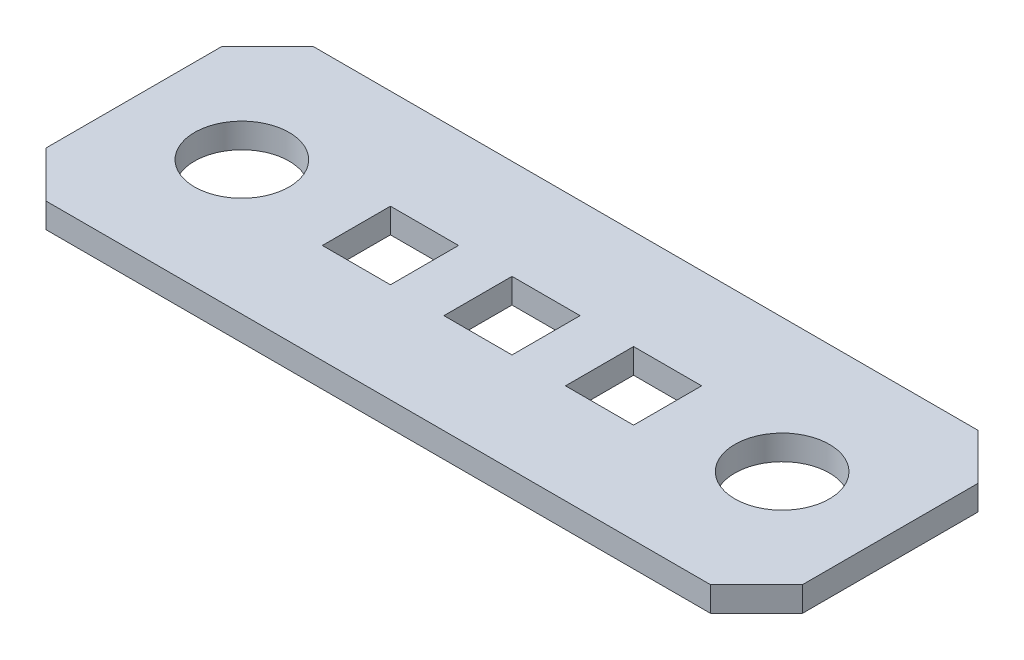
ISO-10303-21;
HEADER;
FILE_DESCRIPTION(('STEP AP214'),'2;1');
FILE_NAME('part.step','',(''),(''),'','','');
FILE_SCHEMA(('AUTOMOTIVE_DESIGN { 1 0 10303 214 1 1 1 1 }'));
ENDSEC;
DATA;
#1=APPLICATION_CONTEXT('core data for automotive mechanical design processes');
#2=APPLICATION_PROTOCOL_DEFINITION('international standard','automotive_design',2000,#1);
#3=PRODUCT_CONTEXT('',#1,'mechanical');
#4=PRODUCT('Part','Part','',(#3));
#5=PRODUCT_RELATED_PRODUCT_CATEGORY('part','',(#4));
#6=PRODUCT_DEFINITION_FORMATION('','',#4);
#7=PRODUCT_DEFINITION_CONTEXT('part definition',#1,'design');
#8=PRODUCT_DEFINITION('design','',#6,#7);
#9=PRODUCT_DEFINITION_SHAPE('','',#8);
#10=(LENGTH_UNIT() NAMED_UNIT(*) SI_UNIT(.MILLI.,.METRE.));
#11=(NAMED_UNIT(*) PLANE_ANGLE_UNIT() SI_UNIT($,.RADIAN.));
#12=(NAMED_UNIT(*) SI_UNIT($,.STERADIAN.) SOLID_ANGLE_UNIT());
#13=UNCERTAINTY_MEASURE_WITH_UNIT(LENGTH_MEASURE(1.E-05),#10,'distance_accuracy_value','');
#14=(GEOMETRIC_REPRESENTATION_CONTEXT(3) GLOBAL_UNCERTAINTY_ASSIGNED_CONTEXT((#13)) GLOBAL_UNIT_ASSIGNED_CONTEXT((#10,
#11,#12)) REPRESENTATION_CONTEXT('',''));
#15=CARTESIAN_POINT('',(0.,0.,0.));
#16=DIRECTION('',(0.,0.,1.));
#17=DIRECTION('',(1.,0.,0.));
#18=AXIS2_PLACEMENT_3D('',#15,#16,#17);
#19=CARTESIAN_POINT('',(0.,0.,0.));
#20=DIRECTION('',(0.,1.,0.));
#21=DIRECTION('',(0.,0.,1.));
#22=AXIS2_PLACEMENT_3D('',#19,#20,#21);
#23=PLANE('',#22);
#24=DIRECTION('',(1.,0.,0.));
#25=VECTOR('',#24,1.);
#26=CARTESIAN_POINT('',(21.8948,0.,-4.6863));
#27=LINE('',#26,#25);
#28=CARTESIAN_POINT('',(21.8948,0.,-4.6863));
#29=VERTEX_POINT('',#28);
#30=CARTESIAN_POINT('',(25.0952,0.,-4.6863));
#31=VERTEX_POINT('',#30);
#32=EDGE_CURVE('E457',#29,#31,#27,.T.);
#33=ORIENTED_EDGE('',*,*,#32,.T.);
#34=DIRECTION('',(0.,0.,-1.));
#35=VECTOR('',#34,1.);
#36=CARTESIAN_POINT('',(25.0952,0.,-7.8867));
#37=LINE('',#36,#35);
#38=CARTESIAN_POINT('',(25.0952,0.,-7.8867));
#39=VERTEX_POINT('',#38);
#40=EDGE_CURVE('E450',#31,#39,#37,.T.);
#41=ORIENTED_EDGE('',*,*,#40,.T.);
#42=DIRECTION('',(-1.,0.,0.));
#43=VECTOR('',#42,1.);
#44=CARTESIAN_POINT('',(21.8948,0.,-7.8867));
#45=LINE('',#44,#43);
#46=CARTESIAN_POINT('',(21.8948,0.,-7.8867));
#47=VERTEX_POINT('',#46);
#48=EDGE_CURVE('E446',#39,#47,#45,.T.);
#49=ORIENTED_EDGE('',*,*,#48,.T.);
#50=DIRECTION('',(0.,0.,1.));
#51=VECTOR('',#50,1.);
#52=CARTESIAN_POINT('',(21.8948,0.,-7.8867));
#53=LINE('',#52,#51);
#54=EDGE_CURVE('E444',#47,#29,#53,.T.);
#55=ORIENTED_EDGE('',*,*,#54,.T.);
#56=EDGE_LOOP('',(#33,#41,#49,#55));
#57=FACE_BOUND('',#56,.T.);
#58=DIRECTION('',(0.707106781186544,0.,0.707106781186551));
#59=VECTOR('',#58,1.);
#60=CARTESIAN_POINT('',(33.401,0.,-12.573));
#61=LINE('',#60,#59);
#62=CARTESIAN_POINT('',(33.401,0.,-12.573));
#63=VERTEX_POINT('',#62);
#64=CARTESIAN_POINT('',(35.56,0.,-10.414));
#65=VERTEX_POINT('',#64);
#66=EDGE_CURVE('E412',#63,#65,#61,.T.);
#67=ORIENTED_EDGE('',*,*,#66,.T.);
#68=DIRECTION('',(0.,0.,1.));
#69=VECTOR('',#68,1.);
#70=CARTESIAN_POINT('',(35.56,0.,-12.573));
#71=LINE('',#70,#69);
#72=CARTESIAN_POINT('',(35.56,0.,-2.15900000000001));
#73=VERTEX_POINT('',#72);
#74=EDGE_CURVE('E410',#65,#73,#71,.T.);
#75=ORIENTED_EDGE('',*,*,#74,.T.);
#76=DIRECTION('',(-0.707106781186548,0.,0.707106781186548));
#77=VECTOR('',#76,1.);
#78=CARTESIAN_POINT('',(35.56,0.,-2.15900000000001));
#79=LINE('',#78,#77);
#80=CARTESIAN_POINT('',(33.401,0.,0.));
#81=VERTEX_POINT('',#80);
#82=EDGE_CURVE('E440',#73,#81,#79,.T.);
#83=ORIENTED_EDGE('',*,*,#82,.T.);
#84=DIRECTION('',(-1.,0.,0.));
#85=VECTOR('',#84,1.);
#86=CARTESIAN_POINT('',(0.,0.,0.));
#87=LINE('',#86,#85);
#88=CARTESIAN_POINT('',(2.15900000000001,0.,0.));
#89=VERTEX_POINT('',#88);
#90=EDGE_CURVE('E434',#81,#89,#87,.T.);
#91=ORIENTED_EDGE('',*,*,#90,.T.);
#92=DIRECTION('',(-0.707106781186548,0.,-0.707106781186548));
#93=VECTOR('',#92,1.);
#94=CARTESIAN_POINT('',(2.15900000000001,0.,0.));
#95=LINE('',#94,#93);
#96=CARTESIAN_POINT('',(0.,0.,-2.15900000000002));
#97=VERTEX_POINT('',#96);
#98=EDGE_CURVE('E428',#89,#97,#95,.T.);
#99=ORIENTED_EDGE('',*,*,#98,.T.);
#100=DIRECTION('',(0.,0.,-1.));
#101=VECTOR('',#100,1.);
#102=CARTESIAN_POINT('',(0.,0.,-12.573));
#103=LINE('',#102,#101);
#104=CARTESIAN_POINT('',(0.,0.,-10.414));
#105=VERTEX_POINT('',#104);
#106=EDGE_CURVE('E424',#97,#105,#103,.T.);
#107=ORIENTED_EDGE('',*,*,#106,.T.);
#108=DIRECTION('',(0.707106781186549,0.,-0.707106781186546));
#109=VECTOR('',#108,1.);
#110=CARTESIAN_POINT('',(0.,0.,-10.414));
#111=LINE('',#110,#109);
#112=CARTESIAN_POINT('',(2.15899999999999,0.,-12.573));
#113=VERTEX_POINT('',#112);
#114=EDGE_CURVE('E420',#105,#113,#111,.T.);
#115=ORIENTED_EDGE('',*,*,#114,.T.);
#116=DIRECTION('',(1.,0.,0.));
#117=VECTOR('',#116,1.);
#118=CARTESIAN_POINT('',(0.,0.,-12.573));
#119=LINE('',#118,#117);
#120=EDGE_CURVE('E416',#113,#63,#119,.T.);
#121=ORIENTED_EDGE('',*,*,#120,.T.);
#122=EDGE_LOOP('',(#67,#75,#83,#91,#99,#107,#115,#121));
#123=FACE_BOUND('',#122,.T.);
#124=DIRECTION('',(0.,0.,1.));
#125=VECTOR('',#124,1.);
#126=CARTESIAN_POINT('',(10.4648,0.,-7.8867));
#127=LINE('',#126,#125);
#128=CARTESIAN_POINT('',(10.4648,0.,-7.8867));
#129=VERTEX_POINT('',#128);
#130=CARTESIAN_POINT('',(10.4648,0.,-4.6863));
#131=VERTEX_POINT('',#130);
#132=EDGE_CURVE('E393',#129,#131,#127,.T.);
#133=ORIENTED_EDGE('',*,*,#132,.T.);
#134=DIRECTION('',(1.,0.,0.));
#135=VECTOR('',#134,1.);
#136=CARTESIAN_POINT('',(10.4648,0.,-4.6863));
#137=LINE('',#136,#135);
#138=CARTESIAN_POINT('',(13.6652,0.,-4.6863));
#139=VERTEX_POINT('',#138);
#140=EDGE_CURVE('E406',#131,#139,#137,.T.);
#141=ORIENTED_EDGE('',*,*,#140,.T.);
#142=DIRECTION('',(0.,0.,-1.));
#143=VECTOR('',#142,1.);
#144=CARTESIAN_POINT('',(13.6652,0.,-7.8867));
#145=LINE('',#144,#143);
#146=CARTESIAN_POINT('',(13.6652,0.,-7.8867));
#147=VERTEX_POINT('',#146);
#148=EDGE_CURVE('E399',#139,#147,#145,.T.);
#149=ORIENTED_EDGE('',*,*,#148,.T.);
#150=DIRECTION('',(-1.,0.,0.));
#151=VECTOR('',#150,1.);
#152=CARTESIAN_POINT('',(10.4648,0.,-7.8867));
#153=LINE('',#152,#151);
#154=EDGE_CURVE('E395',#147,#129,#153,.T.);
#155=ORIENTED_EDGE('',*,*,#154,.T.);
#156=EDGE_LOOP('',(#133,#141,#149,#155));
#157=FACE_BOUND('',#156,.T.);
#158=DIRECTION('',(0.,0.,1.));
#159=VECTOR('',#158,1.);
#160=CARTESIAN_POINT('',(16.1798,0.,-7.8867));
#161=LINE('',#160,#159);
#162=CARTESIAN_POINT('',(16.1798,0.,-7.8867));
#163=VERTEX_POINT('',#162);
#164=CARTESIAN_POINT('',(16.1798,0.,-4.6863));
#165=VERTEX_POINT('',#164);
#166=EDGE_CURVE('E154',#163,#165,#161,.T.);
#167=ORIENTED_EDGE('',*,*,#166,.T.);
#168=DIRECTION('',(1.,0.,0.));
#169=VECTOR('',#168,1.);
#170=CARTESIAN_POINT('',(16.1798,0.,-4.6863));
#171=LINE('',#170,#169);
#172=CARTESIAN_POINT('',(19.3802,0.,-4.6863));
#173=VERTEX_POINT('',#172);
#174=EDGE_CURVE('E387',#165,#173,#171,.T.);
#175=ORIENTED_EDGE('',*,*,#174,.T.);
#176=DIRECTION('',(0.,0.,-1.));
#177=VECTOR('',#176,1.);
#178=CARTESIAN_POINT('',(19.3802,0.,-7.8867));
#179=LINE('',#178,#177);
#180=CARTESIAN_POINT('',(19.3802,0.,-7.8867));
#181=VERTEX_POINT('',#180);
#182=EDGE_CURVE('E149',#173,#181,#179,.T.);
#183=ORIENTED_EDGE('',*,*,#182,.T.);
#184=DIRECTION('',(-1.,0.,0.));
#185=VECTOR('',#184,1.);
#186=CARTESIAN_POINT('',(16.1798,0.,-7.8867));
#187=LINE('',#186,#185);
#188=EDGE_CURVE('E151',#181,#163,#187,.T.);
#189=ORIENTED_EDGE('',*,*,#188,.T.);
#190=EDGE_LOOP('',(#167,#175,#183,#189));
#191=FACE_BOUND('',#190,.T.);
#192=CARTESIAN_POINT('',(5.07999999999998,0.,-6.28650000000001));
#193=DIRECTION('',(0.,1.,0.));
#194=DIRECTION('',(0.,0.,1.));
#195=AXIS2_PLACEMENT_3D('',#192,#193,#194);
#196=CIRCLE('',#195,2.2225);
#197=CARTESIAN_POINT('',(5.07999999999998,0.,-4.06400000000001));
#198=VERTEX_POINT('',#197);
#199=EDGE_CURVE('E167',#198,#198,#196,.T.);
#200=ORIENTED_EDGE('',*,*,#199,.T.);
#201=EDGE_LOOP('',(#200));
#202=FACE_BOUND('',#201,.T.);
#203=CARTESIAN_POINT('',(30.48,0.,-6.28650000000001));
#204=DIRECTION('',(0.,1.,0.));
#205=DIRECTION('',(0.,0.,1.));
#206=AXIS2_PLACEMENT_3D('',#203,#204,#205);
#207=CIRCLE('',#206,2.2225);
#208=CARTESIAN_POINT('',(30.48,0.,-4.06400000000001));
#209=VERTEX_POINT('',#208);
#210=EDGE_CURVE('E17',#209,#209,#207,.T.);
#211=ORIENTED_EDGE('',*,*,#210,.T.);
#212=EDGE_LOOP('',(#211));
#213=FACE_BOUND('',#212,.T.);
#214=ADVANCED_FACE('F14',(#57,#123,#157,#191,#202,#213),#23,.F.);
#215=CARTESIAN_POINT('',(30.48,0.,-6.28650000000001));
#216=DIRECTION('',(0.,1.,0.));
#217=DIRECTION('',(0.,0.,1.));
#218=AXIS2_PLACEMENT_3D('',#215,#216,#217);
#219=CYLINDRICAL_SURFACE('',#218,2.2225);
#220=CARTESIAN_POINT('',(30.48,1.1684,-6.28650000000001));
#221=DIRECTION('',(0.,1.,0.));
#222=DIRECTION('',(0.,0.,1.));
#223=AXIS2_PLACEMENT_3D('',#220,#221,#222);
#224=CIRCLE('',#223,2.2225);
#225=CARTESIAN_POINT('',(30.48,1.1684,-4.06400000000001));
#226=VERTEX_POINT('',#225);
#227=EDGE_CURVE('E182',#226,#226,#224,.F.);
#228=ORIENTED_EDGE('',*,*,#227,.F.);
#229=EDGE_LOOP('',(#228));
#230=FACE_BOUND('',#229,.T.);
#231=ORIENTED_EDGE('',*,*,#210,.F.);
#232=EDGE_LOOP('',(#231));
#233=FACE_BOUND('',#232,.T.);
#234=ADVANCED_FACE('F190',(#230,#233),#219,.F.);
#235=CARTESIAN_POINT('',(5.07999999999998,0.,-6.28650000000001));
#236=DIRECTION('',(0.,1.,0.));
#237=DIRECTION('',(0.,0.,1.));
#238=AXIS2_PLACEMENT_3D('',#235,#236,#237);
#239=CYLINDRICAL_SURFACE('',#238,2.2225);
#240=CARTESIAN_POINT('',(5.07999999999998,1.1684,-6.28650000000001));
#241=DIRECTION('',(0.,1.,0.));
#242=DIRECTION('',(0.,0.,1.));
#243=AXIS2_PLACEMENT_3D('',#240,#241,#242);
#244=CIRCLE('',#243,2.2225);
#245=CARTESIAN_POINT('',(5.07999999999998,1.1684,-4.06400000000001));
#246=VERTEX_POINT('',#245);
#247=EDGE_CURVE('E178',#246,#246,#244,.F.);
#248=ORIENTED_EDGE('',*,*,#247,.F.);
#249=EDGE_LOOP('',(#248));
#250=FACE_BOUND('',#249,.T.);
#251=ORIENTED_EDGE('',*,*,#199,.F.);
#252=EDGE_LOOP('',(#251));
#253=FACE_BOUND('',#252,.T.);
#254=ADVANCED_FACE('F192',(#250,#253),#239,.F.);
#255=CARTESIAN_POINT('',(16.1798,0.,-7.8867));
#256=DIRECTION('',(-1.,0.,0.));
#257=DIRECTION('',(0.,0.,1.));
#258=AXIS2_PLACEMENT_3D('',#255,#256,#257);
#259=PLANE('',#258);
#260=DIRECTION('',(0.,1.,0.));
#261=VECTOR('',#260,1.);
#262=CARTESIAN_POINT('',(16.1798,0.,-4.6863));
#263=LINE('',#262,#261);
#264=CARTESIAN_POINT('',(16.1798,1.1684,-4.6863));
#265=VERTEX_POINT('',#264);
#266=EDGE_CURVE('E165',#265,#165,#263,.F.);
#267=ORIENTED_EDGE('',*,*,#266,.T.);
#268=ORIENTED_EDGE('',*,*,#166,.F.);
#269=DIRECTION('',(0.,1.,0.));
#270=VECTOR('',#269,1.);
#271=CARTESIAN_POINT('',(16.1798,0.,-7.8867));
#272=LINE('',#271,#270);
#273=CARTESIAN_POINT('',(16.1798,1.1684,-7.8867));
#274=VERTEX_POINT('',#273);
#275=EDGE_CURVE('E159',#163,#274,#272,.T.);
#276=ORIENTED_EDGE('',*,*,#275,.T.);
#277=DIRECTION('',(0.,0.,1.));
#278=VECTOR('',#277,1.);
#279=CARTESIAN_POINT('',(16.1798,1.1684,0.));
#280=LINE('',#279,#278);
#281=EDGE_CURVE('E181',#265,#274,#280,.F.);
#282=ORIENTED_EDGE('',*,*,#281,.F.);
#283=EDGE_LOOP('',(#267,#268,#276,#282));
#284=FACE_BOUND('',#283,.T.);
#285=ADVANCED_FACE('F162',(#284),#259,.F.);
#286=CARTESIAN_POINT('',(16.1798,0.,-7.8867));
#287=DIRECTION('',(0.,0.,-1.));
#288=DIRECTION('',(-1.,0.,0.));
#289=AXIS2_PLACEMENT_3D('',#286,#287,#288);
#290=PLANE('',#289);
#291=ORIENTED_EDGE('',*,*,#275,.F.);
#292=ORIENTED_EDGE('',*,*,#188,.F.);
#293=DIRECTION('',(0.,1.,0.));
#294=VECTOR('',#293,1.);
#295=CARTESIAN_POINT('',(19.3802,0.,-7.8867));
#296=LINE('',#295,#294);
#297=CARTESIAN_POINT('',(19.3802,1.1684,-7.8867));
#298=VERTEX_POINT('',#297);
#299=EDGE_CURVE('E174',#181,#298,#296,.T.);
#300=ORIENTED_EDGE('',*,*,#299,.T.);
#301=DIRECTION('',(1.,0.,0.));
#302=VECTOR('',#301,1.);
#303=CARTESIAN_POINT('',(0.,1.1684,-7.8867));
#304=LINE('',#303,#302);
#305=EDGE_CURVE('E171',#274,#298,#304,.T.);
#306=ORIENTED_EDGE('',*,*,#305,.F.);
#307=EDGE_LOOP('',(#291,#292,#300,#306));
#308=FACE_BOUND('',#307,.T.);
#309=ADVANCED_FACE('F169',(#308),#290,.F.);
#310=CARTESIAN_POINT('',(19.3802,0.,-7.8867));
#311=DIRECTION('',(1.,0.,0.));
#312=DIRECTION('',(0.,0.,-1.));
#313=AXIS2_PLACEMENT_3D('',#310,#311,#312);
#314=PLANE('',#313);
#315=ORIENTED_EDGE('',*,*,#299,.F.);
#316=ORIENTED_EDGE('',*,*,#182,.F.);
#317=DIRECTION('',(0.,1.,0.));
#318=VECTOR('',#317,1.);
#319=CARTESIAN_POINT('',(19.3802,0.,-4.6863));
#320=LINE('',#319,#318);
#321=CARTESIAN_POINT('',(19.3802,1.1684,-4.6863));
#322=VERTEX_POINT('',#321);
#323=EDGE_CURVE('E391',#173,#322,#320,.T.);
#324=ORIENTED_EDGE('',*,*,#323,.T.);
#325=DIRECTION('',(0.,0.,1.));
#326=VECTOR('',#325,1.);
#327=CARTESIAN_POINT('',(19.3802,1.1684,0.));
#328=LINE('',#327,#326);
#329=EDGE_CURVE('E386',#298,#322,#328,.T.);
#330=ORIENTED_EDGE('',*,*,#329,.F.);
#331=EDGE_LOOP('',(#315,#316,#324,#330));
#332=FACE_BOUND('',#331,.T.);
#333=ADVANCED_FACE('F278',(#332),#314,.F.);
#334=CARTESIAN_POINT('',(16.1798,0.,-4.6863));
#335=DIRECTION('',(0.,0.,1.));
#336=DIRECTION('',(1.,0.,0.));
#337=AXIS2_PLACEMENT_3D('',#334,#335,#336);
#338=PLANE('',#337);
#339=ORIENTED_EDGE('',*,*,#323,.F.);
#340=ORIENTED_EDGE('',*,*,#174,.F.);
#341=ORIENTED_EDGE('',*,*,#266,.F.);
#342=DIRECTION('',(1.,0.,0.));
#343=VECTOR('',#342,1.);
#344=CARTESIAN_POINT('',(0.,1.1684,-4.6863));
#345=LINE('',#344,#343);
#346=EDGE_CURVE('E463',#322,#265,#345,.F.);
#347=ORIENTED_EDGE('',*,*,#346,.F.);
#348=EDGE_LOOP('',(#339,#340,#341,#347));
#349=FACE_BOUND('',#348,.T.);
#350=ADVANCED_FACE('F274',(#349),#338,.F.);
#351=CARTESIAN_POINT('',(10.4648,0.,-7.8867));
#352=DIRECTION('',(-1.,0.,0.));
#353=DIRECTION('',(0.,0.,1.));
#354=AXIS2_PLACEMENT_3D('',#351,#352,#353);
#355=PLANE('',#354);
#356=DIRECTION('',(0.,1.,0.));
#357=VECTOR('',#356,1.);
#358=CARTESIAN_POINT('',(10.4648,0.,-4.6863));
#359=LINE('',#358,#357);
#360=CARTESIAN_POINT('',(10.4648,1.1684,-4.6863));
#361=VERTEX_POINT('',#360);
#362=EDGE_CURVE('E403',#361,#131,#359,.F.);
#363=ORIENTED_EDGE('',*,*,#362,.T.);
#364=ORIENTED_EDGE('',*,*,#132,.F.);
#365=DIRECTION('',(0.,1.,0.));
#366=VECTOR('',#365,1.);
#367=CARTESIAN_POINT('',(10.4648,0.,-7.8867));
#368=LINE('',#367,#366);
#369=CARTESIAN_POINT('',(10.4648,1.1684,-7.8867));
#370=VERTEX_POINT('',#369);
#371=EDGE_CURVE('E397',#129,#370,#368,.T.);
#372=ORIENTED_EDGE('',*,*,#371,.T.);
#373=DIRECTION('',(0.,0.,1.));
#374=VECTOR('',#373,1.);
#375=CARTESIAN_POINT('',(10.4648,1.1684,0.));
#376=LINE('',#375,#374);
#377=EDGE_CURVE('E466',#361,#370,#376,.F.);
#378=ORIENTED_EDGE('',*,*,#377,.F.);
#379=EDGE_LOOP('',(#363,#364,#372,#378));
#380=FACE_BOUND('',#379,.T.);
#381=ADVANCED_FACE('F270',(#380),#355,.F.);
#382=CARTESIAN_POINT('',(10.4648,0.,-7.8867));
#383=DIRECTION('',(0.,0.,-1.));
#384=DIRECTION('',(-1.,0.,0.));
#385=AXIS2_PLACEMENT_3D('',#382,#383,#384);
#386=PLANE('',#385);
#387=ORIENTED_EDGE('',*,*,#371,.F.);
#388=ORIENTED_EDGE('',*,*,#154,.F.);
#389=DIRECTION('',(0.,1.,0.));
#390=VECTOR('',#389,1.);
#391=CARTESIAN_POINT('',(13.6652,0.,-7.8867));
#392=LINE('',#391,#390);
#393=CARTESIAN_POINT('',(13.6652,1.1684,-7.8867));
#394=VERTEX_POINT('',#393);
#395=EDGE_CURVE('E401',#147,#394,#392,.T.);
#396=ORIENTED_EDGE('',*,*,#395,.T.);
#397=DIRECTION('',(1.,0.,0.));
#398=VECTOR('',#397,1.);
#399=CARTESIAN_POINT('',(0.,1.1684,-7.8867));
#400=LINE('',#399,#398);
#401=EDGE_CURVE('E469',#370,#394,#400,.T.);
#402=ORIENTED_EDGE('',*,*,#401,.F.);
#403=EDGE_LOOP('',(#387,#388,#396,#402));
#404=FACE_BOUND('',#403,.T.);
#405=ADVANCED_FACE('F266',(#404),#386,.F.);
#406=CARTESIAN_POINT('',(13.6652,0.,-7.8867));
#407=DIRECTION('',(1.,0.,0.));
#408=DIRECTION('',(0.,0.,-1.));
#409=AXIS2_PLACEMENT_3D('',#406,#407,#408);
#410=PLANE('',#409);
#411=ORIENTED_EDGE('',*,*,#395,.F.);
#412=ORIENTED_EDGE('',*,*,#148,.F.);
#413=DIRECTION('',(0.,1.,0.));
#414=VECTOR('',#413,1.);
#415=CARTESIAN_POINT('',(13.6652,0.,-4.6863));
#416=LINE('',#415,#414);
#417=CARTESIAN_POINT('',(13.6652,1.1684,-4.6863));
#418=VERTEX_POINT('',#417);
#419=EDGE_CURVE('E408',#139,#418,#416,.T.);
#420=ORIENTED_EDGE('',*,*,#419,.T.);
#421=DIRECTION('',(0.,0.,1.));
#422=VECTOR('',#421,1.);
#423=CARTESIAN_POINT('',(13.6652,1.1684,0.));
#424=LINE('',#423,#422);
#425=EDGE_CURVE('E472',#394,#418,#424,.T.);
#426=ORIENTED_EDGE('',*,*,#425,.F.);
#427=EDGE_LOOP('',(#411,#412,#420,#426));
#428=FACE_BOUND('',#427,.T.);
#429=ADVANCED_FACE('F262',(#428),#410,.F.);
#430=CARTESIAN_POINT('',(10.4648,0.,-4.6863));
#431=DIRECTION('',(0.,0.,1.));
#432=DIRECTION('',(1.,0.,0.));
#433=AXIS2_PLACEMENT_3D('',#430,#431,#432);
#434=PLANE('',#433);
#435=ORIENTED_EDGE('',*,*,#419,.F.);
#436=ORIENTED_EDGE('',*,*,#140,.F.);
#437=ORIENTED_EDGE('',*,*,#362,.F.);
#438=DIRECTION('',(1.,0.,0.));
#439=VECTOR('',#438,1.);
#440=CARTESIAN_POINT('',(0.,1.1684,-4.6863));
#441=LINE('',#440,#439);
#442=EDGE_CURVE('E475',#418,#361,#441,.F.);
#443=ORIENTED_EDGE('',*,*,#442,.F.);
#444=EDGE_LOOP('',(#435,#436,#437,#443));
#445=FACE_BOUND('',#444,.T.);
#446=ADVANCED_FACE('F258',(#445),#434,.F.);
#447=CARTESIAN_POINT('',(35.56,1.1684,-12.573));
#448=DIRECTION('',(-1.,0.,0.));
#449=DIRECTION('',(0.,0.,1.));
#450=AXIS2_PLACEMENT_3D('',#447,#448,#449);
#451=PLANE('',#450);
#452=DIRECTION('',(0.,1.,0.));
#453=VECTOR('',#452,1.);
#454=CARTESIAN_POINT('',(35.56,1.1684,-10.414));
#455=LINE('',#454,#453);
#456=CARTESIAN_POINT('',(35.56,1.1684,-10.414));
#457=VERTEX_POINT('',#456);
#458=EDGE_CURVE('E414',#65,#457,#455,.T.);
#459=ORIENTED_EDGE('',*,*,#458,.T.);
#460=DIRECTION('',(0.,0.,1.));
#461=VECTOR('',#460,1.);
#462=CARTESIAN_POINT('',(35.56,1.1684,0.));
#463=LINE('',#462,#461);
#464=CARTESIAN_POINT('',(35.56,1.1684,-2.15900000000001));
#465=VERTEX_POINT('',#464);
#466=EDGE_CURVE('E478',#465,#457,#463,.F.);
#467=ORIENTED_EDGE('',*,*,#466,.F.);
#468=DIRECTION('',(0.,1.,0.));
#469=VECTOR('',#468,1.);
#470=CARTESIAN_POINT('',(35.56,1.1684,-2.15900000000002));
#471=LINE('',#470,#469);
#472=EDGE_CURVE('E437',#465,#73,#471,.F.);
#473=ORIENTED_EDGE('',*,*,#472,.T.);
#474=ORIENTED_EDGE('',*,*,#74,.F.);
#475=EDGE_LOOP('',(#459,#467,#473,#474));
#476=FACE_BOUND('',#475,.T.);
#477=ADVANCED_FACE('F254',(#476),#451,.F.);
#478=CARTESIAN_POINT('',(33.401,1.1684,-12.573));
#479=DIRECTION('',(-0.707106781186551,0.,0.707106781186544));
#480=DIRECTION('',(0.707106781186544,0.,0.707106781186551));
#481=AXIS2_PLACEMENT_3D('',#478,#479,#480);
#482=PLANE('',#481);
#483=ORIENTED_EDGE('',*,*,#458,.F.);
#484=ORIENTED_EDGE('',*,*,#66,.F.);
#485=DIRECTION('',(0.,1.,0.));
#486=VECTOR('',#485,1.);
#487=CARTESIAN_POINT('',(33.401,1.1684,-12.573));
#488=LINE('',#487,#486);
#489=CARTESIAN_POINT('',(33.401,1.1684,-12.573));
#490=VERTEX_POINT('',#489);
#491=EDGE_CURVE('E418',#63,#490,#488,.T.);
#492=ORIENTED_EDGE('',*,*,#491,.T.);
#493=DIRECTION('',(-0.707106781186544,0.,-0.707106781186551));
#494=VECTOR('',#493,1.);
#495=CARTESIAN_POINT('',(35.56,1.1684,-10.414));
#496=LINE('',#495,#494);
#497=EDGE_CURVE('E481',#457,#490,#496,.T.);
#498=ORIENTED_EDGE('',*,*,#497,.F.);
#499=EDGE_LOOP('',(#483,#484,#492,#498));
#500=FACE_BOUND('',#499,.T.);
#501=ADVANCED_FACE('F250',(#500),#482,.F.);
#502=CARTESIAN_POINT('',(0.,1.1684,-12.573));
#503=DIRECTION('',(0.,0.,1.));
#504=DIRECTION('',(1.,0.,0.));
#505=AXIS2_PLACEMENT_3D('',#502,#503,#504);
#506=PLANE('',#505);
#507=ORIENTED_EDGE('',*,*,#491,.F.);
#508=ORIENTED_EDGE('',*,*,#120,.F.);
#509=DIRECTION('',(0.,1.,0.));
#510=VECTOR('',#509,1.);
#511=CARTESIAN_POINT('',(2.15899999999999,1.1684,-12.573));
#512=LINE('',#511,#510);
#513=CARTESIAN_POINT('',(2.15899999999999,1.1684,-12.573));
#514=VERTEX_POINT('',#513);
#515=EDGE_CURVE('E422',#113,#514,#512,.T.);
#516=ORIENTED_EDGE('',*,*,#515,.T.);
#517=DIRECTION('',(1.,0.,0.));
#518=VECTOR('',#517,1.);
#519=CARTESIAN_POINT('',(0.,1.1684,-12.573));
#520=LINE('',#519,#518);
#521=EDGE_CURVE('E484',#490,#514,#520,.F.);
#522=ORIENTED_EDGE('',*,*,#521,.F.);
#523=EDGE_LOOP('',(#507,#508,#516,#522));
#524=FACE_BOUND('',#523,.T.);
#525=ADVANCED_FACE('F246',(#524),#506,.F.);
#526=CARTESIAN_POINT('',(0.,1.1684,-10.414));
#527=DIRECTION('',(0.707106781186546,0.,0.707106781186549));
#528=DIRECTION('',(0.707106781186549,0.,-0.707106781186546));
#529=AXIS2_PLACEMENT_3D('',#526,#527,#528);
#530=PLANE('',#529);
#531=ORIENTED_EDGE('',*,*,#515,.F.);
#532=ORIENTED_EDGE('',*,*,#114,.F.);
#533=DIRECTION('',(0.,1.,0.));
#534=VECTOR('',#533,1.);
#535=CARTESIAN_POINT('',(0.,1.1684,-10.414));
#536=LINE('',#535,#534);
#537=CARTESIAN_POINT('',(0.,1.1684,-10.414));
#538=VERTEX_POINT('',#537);
#539=EDGE_CURVE('E426',#105,#538,#536,.T.);
#540=ORIENTED_EDGE('',*,*,#539,.T.);
#541=DIRECTION('',(-0.707106781186549,0.,0.707106781186546));
#542=VECTOR('',#541,1.);
#543=CARTESIAN_POINT('',(2.15899999999999,1.1684,-12.573));
#544=LINE('',#543,#542);
#545=EDGE_CURVE('E487',#514,#538,#544,.T.);
#546=ORIENTED_EDGE('',*,*,#545,.F.);
#547=EDGE_LOOP('',(#531,#532,#540,#546));
#548=FACE_BOUND('',#547,.T.);
#549=ADVANCED_FACE('F242',(#548),#530,.F.);
#550=CARTESIAN_POINT('',(0.,1.1684,-12.573));
#551=DIRECTION('',(1.,0.,0.));
#552=DIRECTION('',(0.,0.,-1.));
#553=AXIS2_PLACEMENT_3D('',#550,#551,#552);
#554=PLANE('',#553);
#555=ORIENTED_EDGE('',*,*,#539,.F.);
#556=ORIENTED_EDGE('',*,*,#106,.F.);
#557=DIRECTION('',(0.,1.,0.));
#558=VECTOR('',#557,1.);
#559=CARTESIAN_POINT('',(0.,1.1684,-2.15900000000001));
#560=LINE('',#559,#558);
#561=CARTESIAN_POINT('',(0.,1.1684,-2.15900000000002));
#562=VERTEX_POINT('',#561);
#563=EDGE_CURVE('E430',#97,#562,#560,.T.);
#564=ORIENTED_EDGE('',*,*,#563,.T.);
#565=DIRECTION('',(0.,0.,1.));
#566=VECTOR('',#565,1.);
#567=CARTESIAN_POINT('',(0.,1.1684,0.));
#568=LINE('',#567,#566);
#569=EDGE_CURVE('E490',#538,#562,#568,.T.);
#570=ORIENTED_EDGE('',*,*,#569,.F.);
#571=EDGE_LOOP('',(#555,#556,#564,#570));
#572=FACE_BOUND('',#571,.T.);
#573=ADVANCED_FACE('F238',(#572),#554,.F.);
#574=CARTESIAN_POINT('',(2.15900000000001,1.1684,0.));
#575=DIRECTION('',(0.707106781186548,0.,-0.707106781186548));
#576=DIRECTION('',(-0.707106781186548,0.,-0.707106781186548));
#577=AXIS2_PLACEMENT_3D('',#574,#575,#576);
#578=PLANE('',#577);
#579=ORIENTED_EDGE('',*,*,#563,.F.);
#580=ORIENTED_EDGE('',*,*,#98,.F.);
#581=DIRECTION('',(0.,1.,0.));
#582=VECTOR('',#581,1.);
#583=CARTESIAN_POINT('',(2.15900000000001,1.1684,0.));
#584=LINE('',#583,#582);
#585=CARTESIAN_POINT('',(2.15900000000001,1.1684,0.));
#586=VERTEX_POINT('',#585);
#587=EDGE_CURVE('E432',#89,#586,#584,.T.);
#588=ORIENTED_EDGE('',*,*,#587,.T.);
#589=DIRECTION('',(0.707106781186547,0.,0.707106781186548));
#590=VECTOR('',#589,1.);
#591=CARTESIAN_POINT('',(0.,1.1684,-2.15900000000001));
#592=LINE('',#591,#590);
#593=EDGE_CURVE('E493',#562,#586,#592,.T.);
#594=ORIENTED_EDGE('',*,*,#593,.F.);
#595=EDGE_LOOP('',(#579,#580,#588,#594));
#596=FACE_BOUND('',#595,.T.);
#597=ADVANCED_FACE('F234',(#596),#578,.F.);
#598=CARTESIAN_POINT('',(0.,1.1684,0.));
#599=DIRECTION('',(0.,0.,-1.));
#600=DIRECTION('',(-1.,0.,0.));
#601=AXIS2_PLACEMENT_3D('',#598,#599,#600);
#602=PLANE('',#601);
#603=DIRECTION('',(0.,1.,0.));
#604=VECTOR('',#603,1.);
#605=CARTESIAN_POINT('',(33.401,1.1684,0.));
#606=LINE('',#605,#604);
#607=CARTESIAN_POINT('',(33.4009999999999,1.1684,0.));
#608=VERTEX_POINT('',#607);
#609=EDGE_CURVE('E442',#81,#608,#606,.T.);
#610=ORIENTED_EDGE('',*,*,#609,.T.);
#611=DIRECTION('',(1.,0.,0.));
#612=VECTOR('',#611,1.);
#613=CARTESIAN_POINT('',(0.,1.1684,0.));
#614=LINE('',#613,#612);
#615=EDGE_CURVE('E496',#586,#608,#614,.T.);
#616=ORIENTED_EDGE('',*,*,#615,.F.);
#617=ORIENTED_EDGE('',*,*,#587,.F.);
#618=ORIENTED_EDGE('',*,*,#90,.F.);
#619=EDGE_LOOP('',(#610,#616,#617,#618));
#620=FACE_BOUND('',#619,.T.);
#621=ADVANCED_FACE('F230',(#620),#602,.F.);
#622=CARTESIAN_POINT('',(35.56,1.1684,-2.15900000000001));
#623=DIRECTION('',(-0.707106781186548,0.,-0.707106781186548));
#624=DIRECTION('',(-0.707106781186548,0.,0.707106781186548));
#625=AXIS2_PLACEMENT_3D('',#622,#623,#624);
#626=PLANE('',#625);
#627=ORIENTED_EDGE('',*,*,#609,.F.);
#628=ORIENTED_EDGE('',*,*,#82,.F.);
#629=ORIENTED_EDGE('',*,*,#472,.F.);
#630=DIRECTION('',(0.707106781186548,0.,-0.707106781186547));
#631=VECTOR('',#630,1.);
#632=CARTESIAN_POINT('',(33.4009999999999,1.1684,0.));
#633=LINE('',#632,#631);
#634=EDGE_CURVE('E499',#608,#465,#633,.T.);
#635=ORIENTED_EDGE('',*,*,#634,.F.);
#636=EDGE_LOOP('',(#627,#628,#629,#635));
#637=FACE_BOUND('',#636,.T.);
#638=ADVANCED_FACE('F226',(#637),#626,.F.);
#639=CARTESIAN_POINT('',(21.8948,0.,-7.8867));
#640=DIRECTION('',(-1.,0.,0.));
#641=DIRECTION('',(0.,0.,1.));
#642=AXIS2_PLACEMENT_3D('',#639,#640,#641);
#643=PLANE('',#642);
#644=DIRECTION('',(0.,1.,0.));
#645=VECTOR('',#644,1.);
#646=CARTESIAN_POINT('',(21.8948,0.,-4.6863));
#647=LINE('',#646,#645);
#648=CARTESIAN_POINT('',(21.8948,1.1684,-4.6863));
#649=VERTEX_POINT('',#648);
#650=EDGE_CURVE('E454',#649,#29,#647,.F.);
#651=ORIENTED_EDGE('',*,*,#650,.T.);
#652=ORIENTED_EDGE('',*,*,#54,.F.);
#653=DIRECTION('',(0.,1.,0.));
#654=VECTOR('',#653,1.);
#655=CARTESIAN_POINT('',(21.8948,0.,-7.8867));
#656=LINE('',#655,#654);
#657=CARTESIAN_POINT('',(21.8948,1.1684,-7.8867));
#658=VERTEX_POINT('',#657);
#659=EDGE_CURVE('E448',#47,#658,#656,.T.);
#660=ORIENTED_EDGE('',*,*,#659,.T.);
#661=DIRECTION('',(0.,0.,1.));
#662=VECTOR('',#661,1.);
#663=CARTESIAN_POINT('',(21.8948,1.1684,0.));
#664=LINE('',#663,#662);
#665=EDGE_CURVE('E502',#649,#658,#664,.F.);
#666=ORIENTED_EDGE('',*,*,#665,.F.);
#667=EDGE_LOOP('',(#651,#652,#660,#666));
#668=FACE_BOUND('',#667,.T.);
#669=ADVANCED_FACE('F222',(#668),#643,.F.);
#670=CARTESIAN_POINT('',(21.8948,0.,-7.8867));
#671=DIRECTION('',(0.,0.,-1.));
#672=DIRECTION('',(-1.,0.,0.));
#673=AXIS2_PLACEMENT_3D('',#670,#671,#672);
#674=PLANE('',#673);
#675=ORIENTED_EDGE('',*,*,#659,.F.);
#676=ORIENTED_EDGE('',*,*,#48,.F.);
#677=DIRECTION('',(0.,1.,0.));
#678=VECTOR('',#677,1.);
#679=CARTESIAN_POINT('',(25.0952,0.,-7.8867));
#680=LINE('',#679,#678);
#681=CARTESIAN_POINT('',(25.0952,1.1684,-7.8867));
#682=VERTEX_POINT('',#681);
#683=EDGE_CURVE('E452',#39,#682,#680,.T.);
#684=ORIENTED_EDGE('',*,*,#683,.T.);
#685=DIRECTION('',(1.,0.,0.));
#686=VECTOR('',#685,1.);
#687=CARTESIAN_POINT('',(0.,1.1684,-7.8867));
#688=LINE('',#687,#686);
#689=EDGE_CURVE('E505',#658,#682,#688,.T.);
#690=ORIENTED_EDGE('',*,*,#689,.F.);
#691=EDGE_LOOP('',(#675,#676,#684,#690));
#692=FACE_BOUND('',#691,.T.);
#693=ADVANCED_FACE('F219',(#692),#674,.F.);
#694=CARTESIAN_POINT('',(25.0952,0.,-7.8867));
#695=DIRECTION('',(1.,0.,0.));
#696=DIRECTION('',(0.,0.,-1.));
#697=AXIS2_PLACEMENT_3D('',#694,#695,#696);
#698=PLANE('',#697);
#699=ORIENTED_EDGE('',*,*,#683,.F.);
#700=ORIENTED_EDGE('',*,*,#40,.F.);
#701=DIRECTION('',(0.,1.,0.));
#702=VECTOR('',#701,1.);
#703=CARTESIAN_POINT('',(25.0952,0.,-4.6863));
#704=LINE('',#703,#702);
#705=CARTESIAN_POINT('',(25.0952,1.1684,-4.6863));
#706=VERTEX_POINT('',#705);
#707=EDGE_CURVE('E32',#31,#706,#704,.T.);
#708=ORIENTED_EDGE('',*,*,#707,.T.);
#709=DIRECTION('',(0.,0.,1.));
#710=VECTOR('',#709,1.);
#711=CARTESIAN_POINT('',(25.0952,1.1684,0.));
#712=LINE('',#711,#710);
#713=EDGE_CURVE('E23',#682,#706,#712,.T.);
#714=ORIENTED_EDGE('',*,*,#713,.F.);
#715=EDGE_LOOP('',(#699,#700,#708,#714));
#716=FACE_BOUND('',#715,.T.);
#717=ADVANCED_FACE('F211',(#716),#698,.F.);
#718=CARTESIAN_POINT('',(21.8948,0.,-4.6863));
#719=DIRECTION('',(0.,0.,1.));
#720=DIRECTION('',(1.,0.,0.));
#721=AXIS2_PLACEMENT_3D('',#718,#719,#720);
#722=PLANE('',#721);
#723=ORIENTED_EDGE('',*,*,#707,.F.);
#724=ORIENTED_EDGE('',*,*,#32,.F.);
#725=ORIENTED_EDGE('',*,*,#650,.F.);
#726=DIRECTION('',(1.,0.,0.));
#727=VECTOR('',#726,1.);
#728=CARTESIAN_POINT('',(0.,1.1684,-4.6863));
#729=LINE('',#728,#727);
#730=EDGE_CURVE('E9',#706,#649,#729,.F.);
#731=ORIENTED_EDGE('',*,*,#730,.F.);
#732=EDGE_LOOP('',(#723,#724,#725,#731));
#733=FACE_BOUND('',#732,.T.);
#734=ADVANCED_FACE('F205',(#733),#722,.F.);
#735=CARTESIAN_POINT('',(0.,1.1684,0.));
#736=DIRECTION('',(0.,1.,0.));
#737=DIRECTION('',(0.,0.,1.));
#738=AXIS2_PLACEMENT_3D('',#735,#736,#737);
#739=PLANE('',#738);
#740=ORIENTED_EDGE('',*,*,#713,.T.);
#741=ORIENTED_EDGE('',*,*,#730,.T.);
#742=ORIENTED_EDGE('',*,*,#665,.T.);
#743=ORIENTED_EDGE('',*,*,#689,.T.);
#744=EDGE_LOOP('',(#740,#741,#742,#743));
#745=FACE_BOUND('',#744,.T.);
#746=ORIENTED_EDGE('',*,*,#615,.T.);
#747=ORIENTED_EDGE('',*,*,#634,.T.);
#748=ORIENTED_EDGE('',*,*,#466,.T.);
#749=ORIENTED_EDGE('',*,*,#497,.T.);
#750=ORIENTED_EDGE('',*,*,#521,.T.);
#751=ORIENTED_EDGE('',*,*,#545,.T.);
#752=ORIENTED_EDGE('',*,*,#569,.T.);
#753=ORIENTED_EDGE('',*,*,#593,.T.);
#754=EDGE_LOOP('',(#746,#747,#748,#749,#750,#751,#752,#753));
#755=FACE_BOUND('',#754,.T.);
#756=ORIENTED_EDGE('',*,*,#425,.T.);
#757=ORIENTED_EDGE('',*,*,#442,.T.);
#758=ORIENTED_EDGE('',*,*,#377,.T.);
#759=ORIENTED_EDGE('',*,*,#401,.T.);
#760=EDGE_LOOP('',(#756,#757,#758,#759));
#761=FACE_BOUND('',#760,.T.);
#762=ORIENTED_EDGE('',*,*,#329,.T.);
#763=ORIENTED_EDGE('',*,*,#346,.T.);
#764=ORIENTED_EDGE('',*,*,#281,.T.);
#765=ORIENTED_EDGE('',*,*,#305,.T.);
#766=EDGE_LOOP('',(#762,#763,#764,#765));
#767=FACE_BOUND('',#766,.T.);
#768=ORIENTED_EDGE('',*,*,#247,.T.);
#769=EDGE_LOOP('',(#768));
#770=FACE_BOUND('',#769,.T.);
#771=ORIENTED_EDGE('',*,*,#227,.T.);
#772=EDGE_LOOP('',(#771));
#773=FACE_BOUND('',#772,.T.);
#774=ADVANCED_FACE('F203',(#745,#755,#761,#767,#770,#773),#739,.T.);
#775=CLOSED_SHELL('',(#214,#234,#254,#285,#309,#333,#350,#381,#405,#429,#446,#477,#501,#525,
#549,#573,#597,#621,#638,#669,#693,#717,#734,#774));
#776=MANIFOLD_SOLID_BREP('B1',#775);
#777=ADVANCED_BREP_SHAPE_REPRESENTATION('',(#18,#776),#14);
#778=SHAPE_DEFINITION_REPRESENTATION(#9,#777);
ENDSEC;
END-ISO-10303-21;
